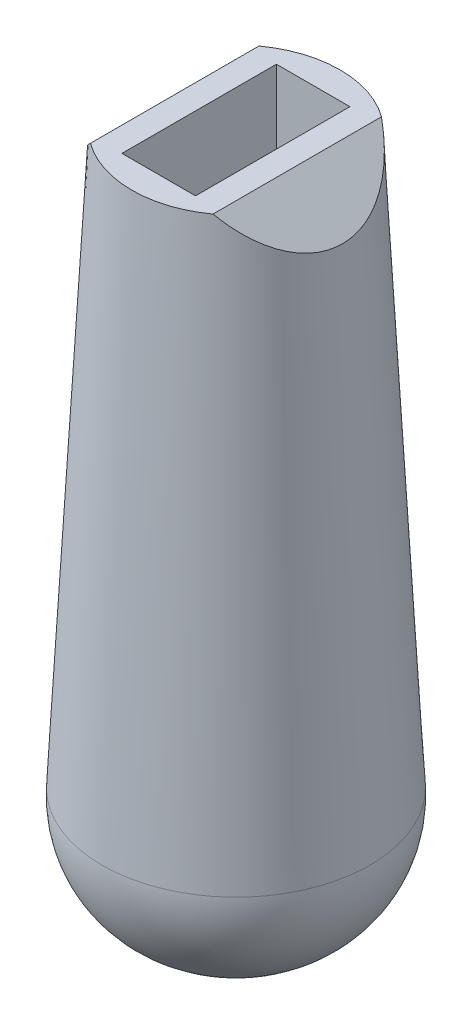
ISO-10303-21;
HEADER;
FILE_DESCRIPTION(('STEP AP214'),'2;1');
FILE_NAME('part.step','',(''),(''),'','','');
FILE_SCHEMA(('AUTOMOTIVE_DESIGN { 1 0 10303 214 1 1 1 1 }'));
ENDSEC;
DATA;
#1=APPLICATION_CONTEXT('core data for automotive mechanical design processes');
#2=APPLICATION_PROTOCOL_DEFINITION('international standard','automotive_design',2000,#1);
#3=PRODUCT_CONTEXT('',#1,'mechanical');
#4=PRODUCT('Part','Part','',(#3));
#5=PRODUCT_RELATED_PRODUCT_CATEGORY('part','',(#4));
#6=PRODUCT_DEFINITION_FORMATION('','',#4);
#7=PRODUCT_DEFINITION_CONTEXT('part definition',#1,'design');
#8=PRODUCT_DEFINITION('design','',#6,#7);
#9=PRODUCT_DEFINITION_SHAPE('','',#8);
#10=(LENGTH_UNIT() NAMED_UNIT(*) SI_UNIT(.MILLI.,.METRE.));
#11=(NAMED_UNIT(*) PLANE_ANGLE_UNIT() SI_UNIT($,.RADIAN.));
#12=(NAMED_UNIT(*) SI_UNIT($,.STERADIAN.) SOLID_ANGLE_UNIT());
#13=UNCERTAINTY_MEASURE_WITH_UNIT(LENGTH_MEASURE(1.E-05),#10,'distance_accuracy_value','');
#14=(GEOMETRIC_REPRESENTATION_CONTEXT(3) GLOBAL_UNCERTAINTY_ASSIGNED_CONTEXT((#13)) GLOBAL_UNIT_ASSIGNED_CONTEXT((#10,
#11,#12)) REPRESENTATION_CONTEXT('',''));
#15=CARTESIAN_POINT('',(0.,0.,0.));
#16=DIRECTION('',(0.,0.,1.));
#17=DIRECTION('',(1.,0.,0.));
#18=AXIS2_PLACEMENT_3D('',#15,#16,#17);
#19=CARTESIAN_POINT('',(0.,0.,0.));
#20=DIRECTION('',(0.,1.,0.));
#21=DIRECTION('',(0.,0.,1.));
#22=AXIS2_PLACEMENT_3D('',#19,#20,#21);
#23=PLANE('',#22);
#24=DIRECTION('',(0.,0.,1.));
#25=VECTOR('',#24,1.);
#26=CARTESIAN_POINT('',(-5.,0.,-23.));
#27=LINE('',#26,#25);
#28=CARTESIAN_POINT('',(-5.,0.,-6.87386354243376));
#29=VERTEX_POINT('',#28);
#30=CARTESIAN_POINT('',(-5.,0.,6.87386354243376));
#31=VERTEX_POINT('',#30);
#32=EDGE_CURVE('E46',#29,#31,#27,.T.);
#33=ORIENTED_EDGE('',*,*,#32,.T.);
#34=CARTESIAN_POINT('',(0.,0.,0.));
#35=DIRECTION('',(0.,1.,0.));
#36=DIRECTION('',(0.,0.,1.));
#37=AXIS2_PLACEMENT_3D('',#34,#35,#36);
#38=CIRCLE('',#37,8.5);
#39=CARTESIAN_POINT('',(5.,0.,6.87386354243376));
#40=VERTEX_POINT('',#39);
#41=EDGE_CURVE('E90',#31,#40,#38,.T.);
#42=ORIENTED_EDGE('',*,*,#41,.T.);
#43=DIRECTION('',(0.,0.,1.));
#44=VECTOR('',#43,1.);
#45=CARTESIAN_POINT('',(5.,0.,-23.));
#46=LINE('',#45,#44);
#47=CARTESIAN_POINT('',(5.,0.,-6.87386354243376));
#48=VERTEX_POINT('',#47);
#49=EDGE_CURVE('E53',#48,#40,#46,.T.);
#50=ORIENTED_EDGE('',*,*,#49,.F.);
#51=EDGE_CURVE('E91',#48,#29,#38,.T.);
#52=ORIENTED_EDGE('',*,*,#51,.T.);
#53=EDGE_LOOP('',(#33,#42,#50,#52));
#54=FACE_BOUND('',#53,.T.);
#55=DIRECTION('',(1.,0.,0.));
#56=VECTOR('',#55,1.);
#57=CARTESIAN_POINT('',(-3.,0.,6.3));
#58=LINE('',#57,#56);
#59=CARTESIAN_POINT('',(-3.,0.,6.3));
#60=VERTEX_POINT('',#59);
#61=CARTESIAN_POINT('',(3.,0.,6.3));
#62=VERTEX_POINT('',#61);
#63=EDGE_CURVE('E95',#60,#62,#58,.T.);
#64=ORIENTED_EDGE('',*,*,#63,.F.);
#65=DIRECTION('',(0.,0.,1.));
#66=VECTOR('',#65,1.);
#67=CARTESIAN_POINT('',(-3.,0.,6.3));
#68=LINE('',#67,#66);
#69=CARTESIAN_POINT('',(-3.,0.,-6.3));
#70=VERTEX_POINT('',#69);
#71=EDGE_CURVE('E126',#70,#60,#68,.T.);
#72=ORIENTED_EDGE('',*,*,#71,.F.);
#73=DIRECTION('',(1.,0.,0.));
#74=VECTOR('',#73,1.);
#75=CARTESIAN_POINT('',(-3.,0.,-6.3));
#76=LINE('',#75,#74);
#77=CARTESIAN_POINT('',(3.,0.,-6.3));
#78=VERTEX_POINT('',#77);
#79=EDGE_CURVE('E99',#70,#78,#76,.T.);
#80=ORIENTED_EDGE('',*,*,#79,.T.);
#81=DIRECTION('',(0.,0.,1.));
#82=VECTOR('',#81,1.);
#83=CARTESIAN_POINT('',(3.,0.,6.3));
#84=LINE('',#83,#82);
#85=EDGE_CURVE('E120',#78,#62,#84,.T.);
#86=ORIENTED_EDGE('',*,*,#85,.T.);
#87=EDGE_LOOP('',(#64,#72,#80,#86));
#88=FACE_BOUND('',#87,.T.);
#89=ADVANCED_FACE('F33',(#54,#88),#23,.T.);
#90=CARTESIAN_POINT('',(0.,-47.,0.));
#91=DIRECTION('',(0.,1.,0.));
#92=DIRECTION('',(0.,0.,1.));
#93=AXIS2_PLACEMENT_3D('',#90,#91,#92);
#94=DEGENERATE_TOROIDAL_SURFACE('',#93,0.94944216632373,10.,.T.);
#95=CARTESIAN_POINT('',(0.,-46.4766404375705,0.));
#96=DIRECTION('',(0.,-1.,0.));
#97=DIRECTION('',(0.,0.,-1.));
#98=AXIS2_PLACEMENT_3D('',#95,#96,#97);
#99=CIRCLE('',#98,10.9357375138695);
#100=CARTESIAN_POINT('',(0.,-46.4766404375705,-10.9357375138695));
#101=VERTEX_POINT('',#100);
#102=EDGE_CURVE('E97',#101,#101,#99,.F.);
#103=ORIENTED_EDGE('',*,*,#102,.F.);
#104=EDGE_LOOP('',(#103));
#105=FACE_BOUND('',#104,.T.);
#106=CARTESIAN_POINT('',(0.,-57.,0.));
#107=DIRECTION('',(0.,1.,0.));
#108=DIRECTION('',(0.,0.,1.));
#109=AXIS2_PLACEMENT_3D('',#106,#107,#108);
#110=CIRCLE('',#109,0.94944216632373);
#111=CARTESIAN_POINT('',(0.,-57.,0.94944216632373));
#112=VERTEX_POINT('',#111);
#113=EDGE_CURVE('E107',#112,#112,#110,.F.);
#114=ORIENTED_EDGE('',*,*,#113,.F.);
#115=EDGE_LOOP('',(#114));
#116=FACE_BOUND('',#115,.T.);
#117=ADVANCED_FACE('F35',(#105,#116),#94,.T.);
#118=CARTESIAN_POINT('',(0.,0.,0.));
#119=DIRECTION('',(0.,-1.,0.));
#120=DIRECTION('',(0.,0.,1.));
#121=AXIS2_PLACEMENT_3D('',#118,#119,#120);
#122=CONICAL_SURFACE('',#121,8.5,0.05235987755983);
#123=CARTESIAN_POINT('',(-0.432922300970338,4.56707769902965,0.));
#124=DIRECTION('',(0.707106781186552,-0.707106781186544,0.));
#125=DIRECTION('',(-0.707106781186544,-0.707106781186552,0.));
#126=AXIS2_PLACEMENT_3D('',#123,#124,#125);
#127=ELLIPSE('',#126,11.6823226983047,8.24929755160915);
#128=EDGE_CURVE('E11',#29,#31,#127,.F.);
#129=ORIENTED_EDGE('',*,*,#128,.F.);
#130=ORIENTED_EDGE('',*,*,#51,.F.);
#131=CARTESIAN_POINT('',(0.432922300970339,4.56707769902964,0.));
#132=DIRECTION('',(-0.707106781186551,-0.707106781186544,0.));
#133=DIRECTION('',(0.707106781186544,-0.707106781186551,0.));
#134=AXIS2_PLACEMENT_3D('',#131,#132,#133);
#135=ELLIPSE('',#134,11.6823226983047,8.24929755160915);
#136=EDGE_CURVE('E41',#40,#48,#135,.F.);
#137=ORIENTED_EDGE('',*,*,#136,.F.);
#138=ORIENTED_EDGE('',*,*,#41,.F.);
#139=EDGE_LOOP('',(#129,#130,#137,#138));
#140=FACE_BOUND('',#139,.T.);
#141=ORIENTED_EDGE('',*,*,#102,.T.);
#142=EDGE_LOOP('',(#141));
#143=FACE_BOUND('',#142,.T.);
#144=ADVANCED_FACE('F93',(#140,#143),#122,.T.);
#145=CARTESIAN_POINT('',(0.,-57.,0.));
#146=DIRECTION('',(0.,1.,0.));
#147=DIRECTION('',(0.,0.,1.));
#148=AXIS2_PLACEMENT_3D('',#145,#146,#147);
#149=PLANE('',#148);
#150=ORIENTED_EDGE('',*,*,#113,.T.);
#151=EDGE_LOOP('',(#150));
#152=FACE_BOUND('',#151,.T.);
#153=ADVANCED_FACE('F170',(#152),#149,.F.);
#154=CARTESIAN_POINT('',(-3.,0.,6.3));
#155=DIRECTION('',(0.,0.,1.));
#156=DIRECTION('',(0.,-1.,0.));
#157=AXIS2_PLACEMENT_3D('',#154,#155,#156);
#158=PLANE('',#157);
#159=DIRECTION('',(0.,-1.,0.));
#160=VECTOR('',#159,1.);
#161=CARTESIAN_POINT('',(3.,0.,6.3));
#162=LINE('',#161,#160);
#163=CARTESIAN_POINT('',(3.,-46.4766404375705,6.29999999999999));
#164=VERTEX_POINT('',#163);
#165=EDGE_CURVE('E110',#62,#164,#162,.T.);
#166=ORIENTED_EDGE('',*,*,#165,.T.);
#167=DIRECTION('',(1.,0.,0.));
#168=VECTOR('',#167,1.);
#169=CARTESIAN_POINT('',(-3.,-46.4766404375705,6.29999999999999));
#170=LINE('',#169,#168);
#171=CARTESIAN_POINT('',(-3.,-46.4766404375705,6.29999999999999));
#172=VERTEX_POINT('',#171);
#173=EDGE_CURVE('E103',#172,#164,#170,.T.);
#174=ORIENTED_EDGE('',*,*,#173,.F.);
#175=DIRECTION('',(0.,-1.,0.));
#176=VECTOR('',#175,1.);
#177=CARTESIAN_POINT('',(-3.,0.,6.3));
#178=LINE('',#177,#176);
#179=EDGE_CURVE('E116',#60,#172,#178,.T.);
#180=ORIENTED_EDGE('',*,*,#179,.F.);
#181=ORIENTED_EDGE('',*,*,#63,.T.);
#182=EDGE_LOOP('',(#166,#174,#180,#181));
#183=FACE_BOUND('',#182,.T.);
#184=ADVANCED_FACE('F148',(#183),#158,.F.);
#185=CARTESIAN_POINT('',(-3.,0.,-6.3));
#186=DIRECTION('',(0.,0.,-1.));
#187=DIRECTION('',(-1.,0.,0.));
#188=AXIS2_PLACEMENT_3D('',#185,#186,#187);
#189=PLANE('',#188);
#190=DIRECTION('',(0.,1.,0.));
#191=VECTOR('',#190,1.);
#192=CARTESIAN_POINT('',(3.,0.,-6.3));
#193=LINE('',#192,#191);
#194=CARTESIAN_POINT('',(3.,-46.4766404375705,-6.3));
#195=VERTEX_POINT('',#194);
#196=EDGE_CURVE('E131',#195,#78,#193,.T.);
#197=ORIENTED_EDGE('',*,*,#196,.T.);
#198=ORIENTED_EDGE('',*,*,#79,.F.);
#199=DIRECTION('',(0.,1.,0.));
#200=VECTOR('',#199,1.);
#201=CARTESIAN_POINT('',(-3.,0.,-6.3));
#202=LINE('',#201,#200);
#203=CARTESIAN_POINT('',(-3.,-46.4766404375705,-6.3));
#204=VERTEX_POINT('',#203);
#205=EDGE_CURVE('E123',#204,#70,#202,.T.);
#206=ORIENTED_EDGE('',*,*,#205,.F.);
#207=DIRECTION('',(1.,0.,0.));
#208=VECTOR('',#207,1.);
#209=CARTESIAN_POINT('',(-3.,-46.4766404375705,-6.3));
#210=LINE('',#209,#208);
#211=EDGE_CURVE('E136',#204,#195,#210,.T.);
#212=ORIENTED_EDGE('',*,*,#211,.T.);
#213=EDGE_LOOP('',(#197,#198,#206,#212));
#214=FACE_BOUND('',#213,.T.);
#215=ADVANCED_FACE('F151',(#214),#189,.F.);
#216=CARTESIAN_POINT('',(-3.,-46.4766404375705,0.));
#217=DIRECTION('',(1.,0.,0.));
#218=DIRECTION('',(0.,0.,-1.));
#219=AXIS2_PLACEMENT_3D('',#216,#217,#218);
#220=CYLINDRICAL_SURFACE('',#219,6.3);
#221=CARTESIAN_POINT('',(3.,-46.4766404375705,0.));
#222=DIRECTION('',(1.,0.,0.));
#223=DIRECTION('',(0.,0.,-1.));
#224=AXIS2_PLACEMENT_3D('',#221,#222,#223);
#225=CIRCLE('',#224,6.3);
#226=EDGE_CURVE('E113',#164,#195,#225,.T.);
#227=ORIENTED_EDGE('',*,*,#226,.T.);
#228=ORIENTED_EDGE('',*,*,#211,.F.);
#229=CARTESIAN_POINT('',(-3.,-46.4766404375705,0.));
#230=DIRECTION('',(1.,0.,0.));
#231=DIRECTION('',(0.,0.,-1.));
#232=AXIS2_PLACEMENT_3D('',#229,#230,#231);
#233=CIRCLE('',#232,6.3);
#234=EDGE_CURVE('E119',#172,#204,#233,.T.);
#235=ORIENTED_EDGE('',*,*,#234,.F.);
#236=ORIENTED_EDGE('',*,*,#173,.T.);
#237=EDGE_LOOP('',(#227,#228,#235,#236));
#238=FACE_BOUND('',#237,.T.);
#239=ADVANCED_FACE('F143',(#238),#220,.F.);
#240=CARTESIAN_POINT('',(-3.,-46.4766404375705,0.));
#241=DIRECTION('',(1.,0.,0.));
#242=DIRECTION('',(0.,0.,-1.));
#243=AXIS2_PLACEMENT_3D('',#240,#241,#242);
#244=PLANE('',#243);
#245=ORIENTED_EDGE('',*,*,#179,.T.);
#246=ORIENTED_EDGE('',*,*,#234,.T.);
#247=ORIENTED_EDGE('',*,*,#205,.T.);
#248=ORIENTED_EDGE('',*,*,#71,.T.);
#249=EDGE_LOOP('',(#245,#246,#247,#248));
#250=FACE_BOUND('',#249,.T.);
#251=ADVANCED_FACE('F153',(#250),#244,.T.);
#252=CARTESIAN_POINT('',(3.,-46.4766404375705,0.));
#253=DIRECTION('',(1.,0.,0.));
#254=DIRECTION('',(0.,0.,-1.));
#255=AXIS2_PLACEMENT_3D('',#252,#253,#254);
#256=PLANE('',#255);
#257=ORIENTED_EDGE('',*,*,#165,.F.);
#258=ORIENTED_EDGE('',*,*,#85,.F.);
#259=ORIENTED_EDGE('',*,*,#196,.F.);
#260=ORIENTED_EDGE('',*,*,#226,.F.);
#261=EDGE_LOOP('',(#257,#258,#259,#260));
#262=FACE_BOUND('',#261,.T.);
#263=ADVANCED_FACE('F146',(#262),#256,.F.);
#264=CARTESIAN_POINT('',(5.,0.,-23.));
#265=DIRECTION('',(-0.707106781186551,-0.707106781186544,0.));
#266=DIRECTION('',(0.707106781186544,-0.707106781186551,0.));
#267=AXIS2_PLACEMENT_3D('',#264,#265,#266);
#268=PLANE('',#267);
#269=ORIENTED_EDGE('',*,*,#136,.T.);
#270=ORIENTED_EDGE('',*,*,#49,.T.);
#271=EDGE_LOOP('',(#269,#270));
#272=FACE_BOUND('',#271,.T.);
#273=ADVANCED_FACE('F109',(#272),#268,.F.);
#274=CARTESIAN_POINT('',(-10.,-5.00000000000012,-23.));
#275=DIRECTION('',(0.707106781186552,-0.707106781186544,0.));
#276=DIRECTION('',(0.707106781186544,0.707106781186552,0.));
#277=AXIS2_PLACEMENT_3D('',#274,#275,#276);
#278=PLANE('',#277);
#279=ORIENTED_EDGE('',*,*,#128,.T.);
#280=ORIENTED_EDGE('',*,*,#32,.F.);
#281=EDGE_LOOP('',(#279,#280));
#282=FACE_BOUND('',#281,.T.);
#283=ADVANCED_FACE('F82',(#282),#278,.F.);
#284=CLOSED_SHELL('',(#89,#117,#144,#153,#184,#215,#239,#251,#263,#273,#283));
#285=MANIFOLD_SOLID_BREP('B2',#284);
#286=ADVANCED_BREP_SHAPE_REPRESENTATION('',(#18,#285),#14);
#287=SHAPE_DEFINITION_REPRESENTATION(#9,#286);
ENDSEC;
END-ISO-10303-21;
